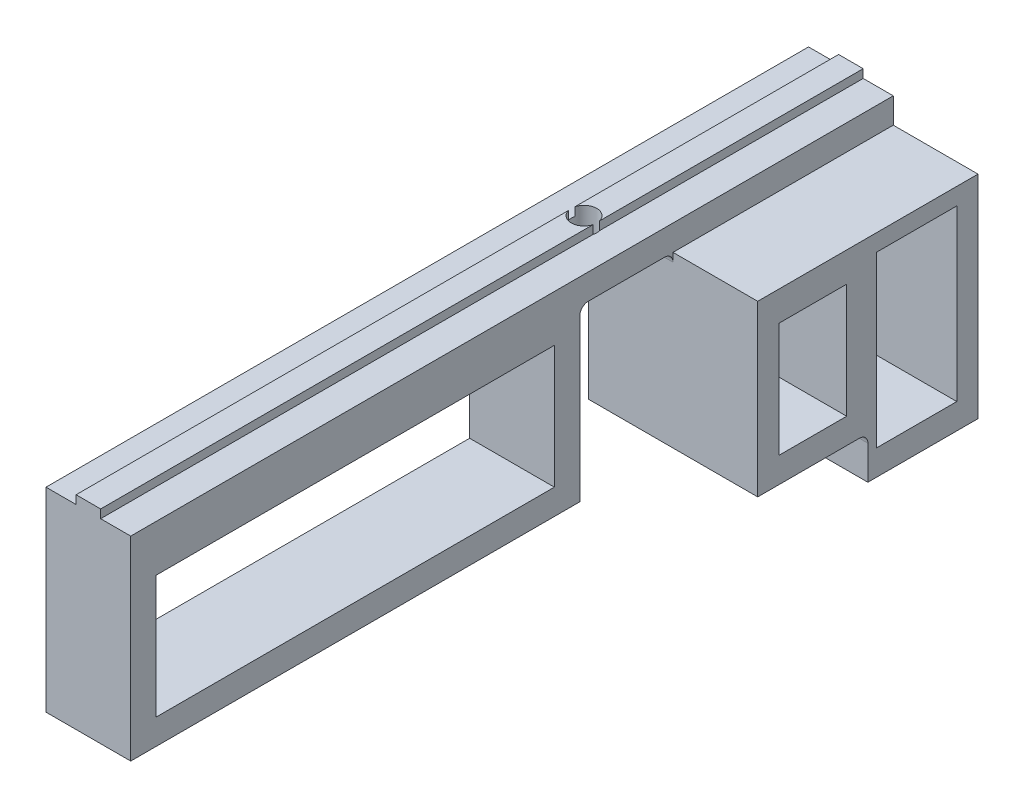
ISO-10303-21;
HEADER;
FILE_DESCRIPTION(('STEP AP214'),'2;1');
FILE_NAME('part.step','',(''),(''),'','','');
FILE_SCHEMA(('AUTOMOTIVE_DESIGN { 1 0 10303 214 1 1 1 1 }'));
ENDSEC;
DATA;
#1=APPLICATION_CONTEXT('core data for automotive mechanical design processes');
#2=APPLICATION_PROTOCOL_DEFINITION('international standard','automotive_design',2000,#1);
#3=PRODUCT_CONTEXT('',#1,'mechanical');
#4=PRODUCT('Part','Part','',(#3));
#5=PRODUCT_RELATED_PRODUCT_CATEGORY('part','',(#4));
#6=PRODUCT_DEFINITION_FORMATION('','',#4);
#7=PRODUCT_DEFINITION_CONTEXT('part definition',#1,'design');
#8=PRODUCT_DEFINITION('design','',#6,#7);
#9=PRODUCT_DEFINITION_SHAPE('','',#8);
#10=(LENGTH_UNIT() NAMED_UNIT(*) SI_UNIT(.MILLI.,.METRE.));
#11=(NAMED_UNIT(*) PLANE_ANGLE_UNIT() SI_UNIT($,.RADIAN.));
#12=(NAMED_UNIT(*) SI_UNIT($,.STERADIAN.) SOLID_ANGLE_UNIT());
#13=UNCERTAINTY_MEASURE_WITH_UNIT(LENGTH_MEASURE(1.E-05),#10,'distance_accuracy_value','');
#14=(GEOMETRIC_REPRESENTATION_CONTEXT(3) GLOBAL_UNCERTAINTY_ASSIGNED_CONTEXT((#13)) GLOBAL_UNIT_ASSIGNED_CONTEXT((#10,
#11,#12)) REPRESENTATION_CONTEXT('',''));
#15=CARTESIAN_POINT('',(0.,0.,0.));
#16=DIRECTION('',(0.,0.,1.));
#17=DIRECTION('',(1.,0.,0.));
#18=AXIS2_PLACEMENT_3D('',#15,#16,#17);
#19=CARTESIAN_POINT('',(-5.,0.,45.));
#20=DIRECTION('',(0.,1.,0.));
#21=DIRECTION('',(-1.,0.,0.));
#22=AXIS2_PLACEMENT_3D('',#19,#20,#21);
#23=PLANE('',#22);
#24=CARTESIAN_POINT('',(0.,0.,-13.5));
#25=DIRECTION('',(0.,-1.,0.));
#26=DIRECTION('',(1.,0.,0.));
#27=AXIS2_PLACEMENT_3D('',#24,#25,#26);
#28=CIRCLE('',#27,1.5);
#29=CARTESIAN_POINT('',(1.5,0.,-13.5));
#30=VERTEX_POINT('',#29);
#31=EDGE_CURVE('E416',#30,#30,#28,.T.);
#32=ORIENTED_EDGE('',*,*,#31,.F.);
#33=EDGE_LOOP('',(#32));
#34=FACE_BOUND('',#33,.T.);
#35=DIRECTION('',(0.,0.,-1.));
#36=VECTOR('',#35,1.);
#37=CARTESIAN_POINT('',(5.,0.,45.));
#38=LINE('',#37,#36);
#39=CARTESIAN_POINT('',(5.,0.,-8.99999999999999));
#40=VERTEX_POINT('',#39);
#41=CARTESIAN_POINT('',(5.,0.,-18.));
#42=VERTEX_POINT('',#41);
#43=EDGE_CURVE('E497',#40,#42,#38,.T.);
#44=ORIENTED_EDGE('',*,*,#43,.F.);
#45=DIRECTION('',(-1.,0.,0.));
#46=VECTOR('',#45,1.);
#47=CARTESIAN_POINT('',(-5.,0.,-9.00000000000001));
#48=LINE('',#47,#46);
#49=CARTESIAN_POINT('',(-5.,0.,-8.99999999999999));
#50=VERTEX_POINT('',#49);
#51=EDGE_CURVE('E512',#40,#50,#48,.T.);
#52=ORIENTED_EDGE('',*,*,#51,.T.);
#53=DIRECTION('',(0.,0.,-1.));
#54=VECTOR('',#53,1.);
#55=CARTESIAN_POINT('',(-5.,0.,45.));
#56=LINE('',#55,#54);
#57=CARTESIAN_POINT('',(-5.,0.,-18.));
#58=VERTEX_POINT('',#57);
#59=EDGE_CURVE('E499',#50,#58,#56,.T.);
#60=ORIENTED_EDGE('',*,*,#59,.T.);
#61=DIRECTION('',(-1.,0.,0.));
#62=VECTOR('',#61,1.);
#63=CARTESIAN_POINT('',(-5.,0.,-18.));
#64=LINE('',#63,#62);
#65=EDGE_CURVE('E510',#58,#42,#64,.F.);
#66=ORIENTED_EDGE('',*,*,#65,.T.);
#67=EDGE_LOOP('',(#44,#52,#60,#66));
#68=FACE_BOUND('',#67,.T.);
#69=ADVANCED_FACE('F33',(#34,#68),#23,.F.);
#70=CARTESIAN_POINT('',(1.45,3.,45.));
#71=DIRECTION('',(-1.,0.,0.));
#72=DIRECTION('',(0.,-1.,0.));
#73=AXIS2_PLACEMENT_3D('',#70,#71,#72);
#74=PLANE('',#73);
#75=DIRECTION('',(0.,0.,-1.));
#76=VECTOR('',#75,1.);
#77=CARTESIAN_POINT('',(1.45,4.,45.));
#78=LINE('',#77,#76);
#79=CARTESIAN_POINT('',(1.45,4.,-13.8840572873934));
#80=VERTEX_POINT('',#79);
#81=CARTESIAN_POINT('',(1.45,4.,-45.));
#82=VERTEX_POINT('',#81);
#83=EDGE_CURVE('E485',#80,#82,#78,.T.);
#84=ORIENTED_EDGE('',*,*,#83,.F.);
#85=DIRECTION('',(0.,-1.,0.));
#86=VECTOR('',#85,1.);
#87=CARTESIAN_POINT('',(1.45,4.,-13.8840572873934));
#88=LINE('',#87,#86);
#89=CARTESIAN_POINT('',(1.45,3.,-13.8840572873934));
#90=VERTEX_POINT('',#89);
#91=EDGE_CURVE('E439',#80,#90,#88,.T.);
#92=ORIENTED_EDGE('',*,*,#91,.T.);
#93=DIRECTION('',(0.,0.,-1.));
#94=VECTOR('',#93,1.);
#95=CARTESIAN_POINT('',(1.45,3.,45.));
#96=LINE('',#95,#94);
#97=CARTESIAN_POINT('',(1.45,3.,-45.));
#98=VERTEX_POINT('',#97);
#99=EDGE_CURVE('E489',#90,#98,#96,.T.);
#100=ORIENTED_EDGE('',*,*,#99,.T.);
#101=DIRECTION('',(0.,1.,0.));
#102=VECTOR('',#101,1.);
#103=CARTESIAN_POINT('',(1.45,3.,-45.));
#104=LINE('',#103,#102);
#105=EDGE_CURVE('E465',#98,#82,#104,.T.);
#106=ORIENTED_EDGE('',*,*,#105,.T.);
#107=EDGE_LOOP('',(#84,#92,#100,#106));
#108=FACE_BOUND('',#107,.T.);
#109=ADVANCED_FACE('F643',(#108),#74,.F.);
#110=CARTESIAN_POINT('',(1.45,4.,45.));
#111=DIRECTION('',(0.,-1.,0.));
#112=DIRECTION('',(0.,0.,-1.));
#113=AXIS2_PLACEMENT_3D('',#110,#111,#112);
#114=PLANE('',#113);
#115=CARTESIAN_POINT('',(1.45,4.,45.));
#116=VERTEX_POINT('',#115);
#117=CARTESIAN_POINT('',(1.45,4.,-13.1159427126066));
#118=VERTEX_POINT('',#117);
#119=EDGE_CURVE('E486',#116,#118,#78,.T.);
#120=ORIENTED_EDGE('',*,*,#119,.T.);
#121=CARTESIAN_POINT('',(0.,4.,-13.5));
#122=DIRECTION('',(0.,-1.,0.));
#123=DIRECTION('',(1.,0.,0.));
#124=AXIS2_PLACEMENT_3D('',#121,#122,#123);
#125=CIRCLE('',#124,1.5);
#126=CARTESIAN_POINT('',(-1.45,4.,-13.1159427126066));
#127=VERTEX_POINT('',#126);
#128=EDGE_CURVE('E421',#118,#127,#125,.T.);
#129=ORIENTED_EDGE('',*,*,#128,.T.);
#130=DIRECTION('',(0.,0.,-1.));
#131=VECTOR('',#130,1.);
#132=CARTESIAN_POINT('',(-1.45,4.,45.));
#133=LINE('',#132,#131);
#134=CARTESIAN_POINT('',(-1.45,4.,45.));
#135=VERTEX_POINT('',#134);
#136=EDGE_CURVE('E482',#135,#127,#133,.T.);
#137=ORIENTED_EDGE('',*,*,#136,.F.);
#138=DIRECTION('',(-1.,0.,0.));
#139=VECTOR('',#138,1.);
#140=CARTESIAN_POINT('',(1.45,4.,45.));
#141=LINE('',#140,#139);
#142=EDGE_CURVE('E452',#116,#135,#141,.T.);
#143=ORIENTED_EDGE('',*,*,#142,.F.);
#144=EDGE_LOOP('',(#120,#129,#137,#143));
#145=FACE_BOUND('',#144,.T.);
#146=ADVANCED_FACE('F649',(#145),#114,.F.);
#147=CARTESIAN_POINT('',(-1.45,4.,45.));
#148=DIRECTION('',(1.,0.,0.));
#149=DIRECTION('',(0.,1.,0.));
#150=AXIS2_PLACEMENT_3D('',#147,#148,#149);
#151=PLANE('',#150);
#152=ORIENTED_EDGE('',*,*,#136,.T.);
#153=DIRECTION('',(0.,-1.,0.));
#154=VECTOR('',#153,1.);
#155=CARTESIAN_POINT('',(-1.45,4.,-13.1159427126066));
#156=LINE('',#155,#154);
#157=CARTESIAN_POINT('',(-1.45,3.,-13.1159427126066));
#158=VERTEX_POINT('',#157);
#159=EDGE_CURVE('E430',#127,#158,#156,.T.);
#160=ORIENTED_EDGE('',*,*,#159,.T.);
#161=DIRECTION('',(0.,0.,-1.));
#162=VECTOR('',#161,1.);
#163=CARTESIAN_POINT('',(-1.45,3.,45.));
#164=LINE('',#163,#162);
#165=CARTESIAN_POINT('',(-1.45,3.,45.));
#166=VERTEX_POINT('',#165);
#167=EDGE_CURVE('E478',#166,#158,#164,.T.);
#168=ORIENTED_EDGE('',*,*,#167,.F.);
#169=DIRECTION('',(0.,-1.,0.));
#170=VECTOR('',#169,1.);
#171=CARTESIAN_POINT('',(-1.45,4.,45.));
#172=LINE('',#171,#170);
#173=EDGE_CURVE('E454',#135,#166,#172,.T.);
#174=ORIENTED_EDGE('',*,*,#173,.F.);
#175=EDGE_LOOP('',(#152,#160,#168,#174));
#176=FACE_BOUND('',#175,.T.);
#177=ADVANCED_FACE('F626',(#176),#151,.F.);
#178=CARTESIAN_POINT('',(-5.,3.,45.));
#179=DIRECTION('',(1.,0.,0.));
#180=DIRECTION('',(0.,1.,0.));
#181=AXIS2_PLACEMENT_3D('',#178,#179,#180);
#182=PLANE('',#181);
#183=DIRECTION('',(0.,-1.,0.));
#184=VECTOR('',#183,1.);
#185=CARTESIAN_POINT('',(-5.,3.,-45.));
#186=LINE('',#185,#184);
#187=CARTESIAN_POINT('',(-5.,3.,-45.));
#188=VERTEX_POINT('',#187);
#189=CARTESIAN_POINT('',(-4.99999999999999,-25.,-45.));
#190=VERTEX_POINT('',#189);
#191=EDGE_CURVE('E442',#188,#190,#186,.T.);
#192=ORIENTED_EDGE('',*,*,#191,.T.);
#193=DIRECTION('',(0.,0.,1.));
#194=VECTOR('',#193,1.);
#195=CARTESIAN_POINT('',(-4.99999999999999,-25.,-32.));
#196=LINE('',#195,#194);
#197=CARTESIAN_POINT('',(-4.99999999999999,-25.,-32.));
#198=VERTEX_POINT('',#197);
#199=EDGE_CURVE('E388',#190,#198,#196,.T.);
#200=ORIENTED_EDGE('',*,*,#199,.T.);
#201=DIRECTION('',(0.,1.,0.));
#202=VECTOR('',#201,1.);
#203=CARTESIAN_POINT('',(-4.99999999999999,-25.,-32.));
#204=LINE('',#203,#202);
#205=CARTESIAN_POINT('',(-4.99999999999999,-21.,-32.));
#206=VERTEX_POINT('',#205);
#207=EDGE_CURVE('E399',#198,#206,#204,.T.);
#208=ORIENTED_EDGE('',*,*,#207,.T.);
#209=CARTESIAN_POINT('',(-4.99999999999999,-21.,-31.));
#210=DIRECTION('',(1.,0.,0.));
#211=DIRECTION('',(0.,1.,0.));
#212=AXIS2_PLACEMENT_3D('',#209,#210,#211);
#213=CIRCLE('',#212,1.);
#214=CARTESIAN_POINT('',(-4.99999999999999,-20.,-31.));
#215=VERTEX_POINT('',#214);
#216=EDGE_CURVE('E521',#206,#215,#213,.T.);
#217=ORIENTED_EDGE('',*,*,#216,.T.);
#218=DIRECTION('',(0.,0.,1.));
#219=VECTOR('',#218,1.);
#220=CARTESIAN_POINT('',(-4.99999999999999,-20.,-32.));
#221=LINE('',#220,#219);
#222=CARTESIAN_POINT('',(-4.99999999999999,-20.,-19.));
#223=VERTEX_POINT('',#222);
#224=EDGE_CURVE('E352',#215,#223,#221,.T.);
#225=ORIENTED_EDGE('',*,*,#224,.T.);
#226=DIRECTION('',(0.,1.,0.));
#227=VECTOR('',#226,1.);
#228=CARTESIAN_POINT('',(-5.,0.,-19.));
#229=LINE('',#228,#227);
#230=CARTESIAN_POINT('',(-5.,-0.999999999999999,-19.));
#231=VERTEX_POINT('',#230);
#232=EDGE_CURVE('E341',#223,#231,#229,.T.);
#233=ORIENTED_EDGE('',*,*,#232,.T.);
#234=CARTESIAN_POINT('',(-5.,-1.,-18.));
#235=DIRECTION('',(1.,0.,0.));
#236=DIRECTION('',(0.,1.,0.));
#237=AXIS2_PLACEMENT_3D('',#234,#235,#236);
#238=CIRCLE('',#237,1.);
#239=EDGE_CURVE('E41',#231,#58,#238,.T.);
#240=ORIENTED_EDGE('',*,*,#239,.T.);
#241=ORIENTED_EDGE('',*,*,#59,.F.);
#242=CARTESIAN_POINT('',(-5.,-1.,-9.00000000000001));
#243=DIRECTION('',(1.,0.,0.));
#244=DIRECTION('',(0.,1.,0.));
#245=AXIS2_PLACEMENT_3D('',#242,#243,#244);
#246=CIRCLE('',#245,1.);
#247=CARTESIAN_POINT('',(-5.,-1.,-8.));
#248=VERTEX_POINT('',#247);
#249=EDGE_CURVE('E525',#50,#248,#246,.T.);
#250=ORIENTED_EDGE('',*,*,#249,.T.);
#251=DIRECTION('',(0.,-1.,0.));
#252=VECTOR('',#251,1.);
#253=CARTESIAN_POINT('',(-5.,0.,-8.));
#254=LINE('',#253,#252);
#255=CARTESIAN_POINT('',(-4.99999999999999,-20.,-8.));
#256=VERTEX_POINT('',#255);
#257=EDGE_CURVE('E296',#248,#256,#254,.T.);
#258=ORIENTED_EDGE('',*,*,#257,.T.);
#259=DIRECTION('',(0.,0.,1.));
#260=VECTOR('',#259,1.);
#261=CARTESIAN_POINT('',(-4.99999999999999,-20.,-8.));
#262=LINE('',#261,#260);
#263=CARTESIAN_POINT('',(-4.99999999999999,-20.,45.));
#264=VERTEX_POINT('',#263);
#265=EDGE_CURVE('E303',#256,#264,#262,.T.);
#266=ORIENTED_EDGE('',*,*,#265,.T.);
#267=DIRECTION('',(0.,-1.,0.));
#268=VECTOR('',#267,1.);
#269=CARTESIAN_POINT('',(-5.,3.,45.));
#270=LINE('',#269,#268);
#271=CARTESIAN_POINT('',(-5.,3.,45.));
#272=VERTEX_POINT('',#271);
#273=EDGE_CURVE('E443',#272,#264,#270,.T.);
#274=ORIENTED_EDGE('',*,*,#273,.F.);
#275=DIRECTION('',(0.,0.,-1.));
#276=VECTOR('',#275,1.);
#277=CARTESIAN_POINT('',(-5.,3.,45.));
#278=LINE('',#277,#276);
#279=EDGE_CURVE('E458',#272,#188,#278,.T.);
#280=ORIENTED_EDGE('',*,*,#279,.T.);
#281=EDGE_LOOP('',(#192,#200,#208,#217,#225,#233,#240,#241,#250,#258,#266,#274,#280));
#282=FACE_BOUND('',#281,.T.);
#283=DIRECTION('',(0.,-1.,0.));
#284=VECTOR('',#283,1.);
#285=CARTESIAN_POINT('',(-5.,-2.,-42.5));
#286=LINE('',#285,#284);
#287=CARTESIAN_POINT('',(-5.,-2.,-42.5));
#288=VERTEX_POINT('',#287);
#289=CARTESIAN_POINT('',(-4.99999999999999,-22.,-42.5));
#290=VERTEX_POINT('',#289);
#291=EDGE_CURVE('E361',#288,#290,#286,.T.);
#292=ORIENTED_EDGE('',*,*,#291,.F.);
#293=DIRECTION('',(0.,0.,-1.));
#294=VECTOR('',#293,1.);
#295=CARTESIAN_POINT('',(-5.,-2.,-42.5));
#296=LINE('',#295,#294);
#297=CARTESIAN_POINT('',(-5.,-2.,-33.));
#298=VERTEX_POINT('',#297);
#299=EDGE_CURVE('E367',#298,#288,#296,.T.);
#300=ORIENTED_EDGE('',*,*,#299,.F.);
#301=DIRECTION('',(0.,1.,0.));
#302=VECTOR('',#301,1.);
#303=CARTESIAN_POINT('',(-5.,-2.,-33.));
#304=LINE('',#303,#302);
#305=CARTESIAN_POINT('',(-4.99999999999999,-22.,-33.));
#306=VERTEX_POINT('',#305);
#307=EDGE_CURVE('E381',#306,#298,#304,.T.);
#308=ORIENTED_EDGE('',*,*,#307,.F.);
#309=DIRECTION('',(0.,0.,1.));
#310=VECTOR('',#309,1.);
#311=CARTESIAN_POINT('',(-4.99999999999999,-22.,-42.5));
#312=LINE('',#311,#310);
#313=EDGE_CURVE('E378',#290,#306,#312,.T.);
#314=ORIENTED_EDGE('',*,*,#313,.F.);
#315=EDGE_LOOP('',(#292,#300,#308,#314));
#316=FACE_BOUND('',#315,.T.);
#317=DIRECTION('',(0.,-1.,0.));
#318=VECTOR('',#317,1.);
#319=CARTESIAN_POINT('',(-5.,-3.5,-29.5));
#320=LINE('',#319,#318);
#321=CARTESIAN_POINT('',(-5.,-3.5,-29.5));
#322=VERTEX_POINT('',#321);
#323=CARTESIAN_POINT('',(-4.99999999999999,-17.,-29.5));
#324=VERTEX_POINT('',#323);
#325=EDGE_CURVE('E313',#322,#324,#320,.T.);
#326=ORIENTED_EDGE('',*,*,#325,.F.);
#327=DIRECTION('',(0.,0.,-1.));
#328=VECTOR('',#327,1.);
#329=CARTESIAN_POINT('',(-5.,-3.5,-29.5));
#330=LINE('',#329,#328);
#331=CARTESIAN_POINT('',(-5.,-3.5,-21.5));
#332=VERTEX_POINT('',#331);
#333=EDGE_CURVE('E320',#332,#322,#330,.T.);
#334=ORIENTED_EDGE('',*,*,#333,.F.);
#335=DIRECTION('',(0.,1.,0.));
#336=VECTOR('',#335,1.);
#337=CARTESIAN_POINT('',(-5.,-3.5,-21.5));
#338=LINE('',#337,#336);
#339=CARTESIAN_POINT('',(-4.99999999999999,-17.,-21.5));
#340=VERTEX_POINT('',#339);
#341=EDGE_CURVE('E334',#340,#332,#338,.T.);
#342=ORIENTED_EDGE('',*,*,#341,.F.);
#343=DIRECTION('',(0.,0.,1.));
#344=VECTOR('',#343,1.);
#345=CARTESIAN_POINT('',(-4.99999999999999,-17.,-29.5));
#346=LINE('',#345,#344);
#347=EDGE_CURVE('E331',#324,#340,#346,.T.);
#348=ORIENTED_EDGE('',*,*,#347,.F.);
#349=EDGE_LOOP('',(#326,#334,#342,#348));
#350=FACE_BOUND('',#349,.T.);
#351=DIRECTION('',(0.,-1.,0.));
#352=VECTOR('',#351,1.);
#353=CARTESIAN_POINT('',(-5.,-2.5,-5.));
#354=LINE('',#353,#352);
#355=CARTESIAN_POINT('',(-5.,-2.5,-5.));
#356=VERTEX_POINT('',#355);
#357=CARTESIAN_POINT('',(-4.99999999999999,-17.,-5.));
#358=VERTEX_POINT('',#357);
#359=EDGE_CURVE('E264',#356,#358,#354,.T.);
#360=ORIENTED_EDGE('',*,*,#359,.F.);
#361=DIRECTION('',(0.,0.,-1.));
#362=VECTOR('',#361,1.);
#363=CARTESIAN_POINT('',(-5.,-2.5,-5.));
#364=LINE('',#363,#362);
#365=CARTESIAN_POINT('',(-5.,-2.5,42.));
#366=VERTEX_POINT('',#365);
#367=EDGE_CURVE('E281',#366,#356,#364,.T.);
#368=ORIENTED_EDGE('',*,*,#367,.F.);
#369=DIRECTION('',(0.,1.,0.));
#370=VECTOR('',#369,1.);
#371=CARTESIAN_POINT('',(-5.,-2.5,42.));
#372=LINE('',#371,#370);
#373=CARTESIAN_POINT('',(-4.99999999999999,-17.,42.));
#374=VERTEX_POINT('',#373);
#375=EDGE_CURVE('E284',#374,#366,#372,.T.);
#376=ORIENTED_EDGE('',*,*,#375,.F.);
#377=DIRECTION('',(0.,0.,1.));
#378=VECTOR('',#377,1.);
#379=CARTESIAN_POINT('',(-4.99999999999999,-17.,-5.));
#380=LINE('',#379,#378);
#381=EDGE_CURVE('E290',#358,#374,#380,.T.);
#382=ORIENTED_EDGE('',*,*,#381,.F.);
#383=EDGE_LOOP('',(#360,#368,#376,#382));
#384=FACE_BOUND('',#383,.T.);
#385=ADVANCED_FACE('F530',(#282,#316,#350,#384),#182,.F.);
#386=CARTESIAN_POINT('',(5.,0.,45.));
#387=DIRECTION('',(-1.,0.,0.));
#388=DIRECTION('',(0.,-1.,0.));
#389=AXIS2_PLACEMENT_3D('',#386,#387,#388);
#390=PLANE('',#389);
#391=DIRECTION('',(0.,1.,0.));
#392=VECTOR('',#391,1.);
#393=CARTESIAN_POINT('',(5.,0.,-45.));
#394=LINE('',#393,#392);
#395=CARTESIAN_POINT('',(5.,0.,-45.));
#396=VERTEX_POINT('',#395);
#397=CARTESIAN_POINT('',(5.,3.,-45.));
#398=VERTEX_POINT('',#397);
#399=EDGE_CURVE('E460',#396,#398,#394,.T.);
#400=ORIENTED_EDGE('',*,*,#399,.T.);
#401=DIRECTION('',(0.,0.,-1.));
#402=VECTOR('',#401,1.);
#403=CARTESIAN_POINT('',(5.,3.,45.));
#404=LINE('',#403,#402);
#405=CARTESIAN_POINT('',(5.,3.,45.));
#406=VERTEX_POINT('',#405);
#407=EDGE_CURVE('E493',#406,#398,#404,.T.);
#408=ORIENTED_EDGE('',*,*,#407,.F.);
#409=DIRECTION('',(0.,1.,0.));
#410=VECTOR('',#409,1.);
#411=CARTESIAN_POINT('',(5.,0.,45.));
#412=LINE('',#411,#410);
#413=CARTESIAN_POINT('',(5.00000000000001,-20.,45.));
#414=VERTEX_POINT('',#413);
#415=EDGE_CURVE('E445',#414,#406,#412,.T.);
#416=ORIENTED_EDGE('',*,*,#415,.F.);
#417=DIRECTION('',(0.,0.,1.));
#418=VECTOR('',#417,1.);
#419=CARTESIAN_POINT('',(5.00000000000001,-20.,-8.));
#420=LINE('',#419,#418);
#421=CARTESIAN_POINT('',(5.00000000000001,-20.,-8.));
#422=VERTEX_POINT('',#421);
#423=EDGE_CURVE('E302',#422,#414,#420,.T.);
#424=ORIENTED_EDGE('',*,*,#423,.F.);
#425=DIRECTION('',(0.,-1.,0.));
#426=VECTOR('',#425,1.);
#427=CARTESIAN_POINT('',(5.,0.,-8.));
#428=LINE('',#427,#426);
#429=CARTESIAN_POINT('',(5.,-0.999999999999998,-8.));
#430=VERTEX_POINT('',#429);
#431=EDGE_CURVE('E300',#430,#422,#428,.T.);
#432=ORIENTED_EDGE('',*,*,#431,.F.);
#433=CARTESIAN_POINT('',(5.,-0.999999999999998,-9.00000000000001));
#434=DIRECTION('',(-1.,0.,0.));
#435=DIRECTION('',(0.,-1.,0.));
#436=AXIS2_PLACEMENT_3D('',#433,#434,#435);
#437=CIRCLE('',#436,1.);
#438=EDGE_CURVE('E527',#430,#40,#437,.T.);
#439=ORIENTED_EDGE('',*,*,#438,.T.);
#440=ORIENTED_EDGE('',*,*,#43,.T.);
#441=CARTESIAN_POINT('',(5.,-0.999999999999998,-18.));
#442=DIRECTION('',(-1.,0.,0.));
#443=DIRECTION('',(0.,-1.,0.));
#444=AXIS2_PLACEMENT_3D('',#441,#442,#443);
#445=CIRCLE('',#444,1.);
#446=CARTESIAN_POINT('',(5.,-0.999999999999998,-19.));
#447=VERTEX_POINT('',#446);
#448=EDGE_CURVE('E11',#42,#447,#445,.T.);
#449=ORIENTED_EDGE('',*,*,#448,.T.);
#450=DIRECTION('',(0.,-1.,0.));
#451=VECTOR('',#450,1.);
#452=CARTESIAN_POINT('',(5.,0.,-19.));
#453=LINE('',#452,#451);
#454=CARTESIAN_POINT('',(5.,0.,-19.));
#455=VERTEX_POINT('',#454);
#456=EDGE_CURVE('E47',#455,#447,#453,.T.);
#457=ORIENTED_EDGE('',*,*,#456,.F.);
#458=EDGE_CURVE('E496',#455,#396,#38,.T.);
#459=ORIENTED_EDGE('',*,*,#458,.T.);
#460=EDGE_LOOP('',(#400,#408,#416,#424,#432,#439,#440,#449,#457,#459));
#461=FACE_BOUND('',#460,.T.);
#462=DIRECTION('',(0.,0.,-1.));
#463=VECTOR('',#462,1.);
#464=CARTESIAN_POINT('',(5.,-2.5,-5.));
#465=LINE('',#464,#463);
#466=CARTESIAN_POINT('',(5.,-2.5,42.));
#467=VERTEX_POINT('',#466);
#468=CARTESIAN_POINT('',(5.,-2.5,-5.));
#469=VERTEX_POINT('',#468);
#470=EDGE_CURVE('E269',#467,#469,#465,.T.);
#471=ORIENTED_EDGE('',*,*,#470,.T.);
#472=DIRECTION('',(0.,-1.,0.));
#473=VECTOR('',#472,1.);
#474=CARTESIAN_POINT('',(5.,-2.5,-5.));
#475=LINE('',#474,#473);
#476=CARTESIAN_POINT('',(5.00000000000001,-17.,-5.));
#477=VERTEX_POINT('',#476);
#478=EDGE_CURVE('E261',#469,#477,#475,.T.);
#479=ORIENTED_EDGE('',*,*,#478,.T.);
#480=DIRECTION('',(0.,0.,1.));
#481=VECTOR('',#480,1.);
#482=CARTESIAN_POINT('',(5.00000000000001,-17.,-5.));
#483=LINE('',#482,#481);
#484=CARTESIAN_POINT('',(5.00000000000001,-17.,42.));
#485=VERTEX_POINT('',#484);
#486=EDGE_CURVE('E273',#477,#485,#483,.T.);
#487=ORIENTED_EDGE('',*,*,#486,.T.);
#488=DIRECTION('',(0.,1.,0.));
#489=VECTOR('',#488,1.);
#490=CARTESIAN_POINT('',(5.,-2.5,42.));
#491=LINE('',#490,#489);
#492=EDGE_CURVE('E277',#485,#467,#491,.T.);
#493=ORIENTED_EDGE('',*,*,#492,.T.);
#494=EDGE_LOOP('',(#471,#479,#487,#493));
#495=FACE_BOUND('',#494,.T.);
#496=ADVANCED_FACE('F279',(#461,#495),#390,.F.);
#497=CARTESIAN_POINT('',(5.,3.,45.));
#498=DIRECTION('',(0.,-1.,0.));
#499=DIRECTION('',(1.,0.,0.));
#500=AXIS2_PLACEMENT_3D('',#497,#498,#499);
#501=PLANE('',#500);
#502=ORIENTED_EDGE('',*,*,#99,.F.);
#503=CARTESIAN_POINT('',(0.,3.,-13.5));
#504=DIRECTION('',(0.,-1.,0.));
#505=DIRECTION('',(1.,0.,0.));
#506=AXIS2_PLACEMENT_3D('',#503,#504,#505);
#507=CIRCLE('',#506,1.5);
#508=CARTESIAN_POINT('',(1.45,3.,-13.1159427126066));
#509=VERTEX_POINT('',#508);
#510=EDGE_CURVE('E436',#90,#509,#507,.T.);
#511=ORIENTED_EDGE('',*,*,#510,.T.);
#512=CARTESIAN_POINT('',(1.45,3.,45.));
#513=VERTEX_POINT('',#512);
#514=EDGE_CURVE('E490',#513,#509,#96,.T.);
#515=ORIENTED_EDGE('',*,*,#514,.F.);
#516=DIRECTION('',(-1.,0.,0.));
#517=VECTOR('',#516,1.);
#518=CARTESIAN_POINT('',(5.,3.,45.));
#519=LINE('',#518,#517);
#520=EDGE_CURVE('E448',#406,#513,#519,.T.);
#521=ORIENTED_EDGE('',*,*,#520,.F.);
#522=ORIENTED_EDGE('',*,*,#407,.T.);
#523=DIRECTION('',(-1.,0.,0.));
#524=VECTOR('',#523,1.);
#525=CARTESIAN_POINT('',(5.,3.,-45.));
#526=LINE('',#525,#524);
#527=EDGE_CURVE('E462',#398,#98,#526,.T.);
#528=ORIENTED_EDGE('',*,*,#527,.T.);
#529=EDGE_LOOP('',(#502,#511,#515,#521,#522,#528));
#530=FACE_BOUND('',#529,.T.);
#531=ADVANCED_FACE('F558',(#530),#501,.F.);
#532=ORIENTED_EDGE('',*,*,#514,.T.);
#533=DIRECTION('',(0.,-1.,0.));
#534=VECTOR('',#533,1.);
#535=CARTESIAN_POINT('',(1.45,4.,-13.1159427126066));
#536=LINE('',#535,#534);
#537=EDGE_CURVE('E433',#509,#118,#536,.F.);
#538=ORIENTED_EDGE('',*,*,#537,.T.);
#539=ORIENTED_EDGE('',*,*,#119,.F.);
#540=DIRECTION('',(0.,1.,0.));
#541=VECTOR('',#540,1.);
#542=CARTESIAN_POINT('',(1.45,3.,45.));
#543=LINE('',#542,#541);
#544=EDGE_CURVE('E450',#513,#116,#543,.T.);
#545=ORIENTED_EDGE('',*,*,#544,.F.);
#546=EDGE_LOOP('',(#532,#538,#539,#545));
#547=FACE_BOUND('',#546,.T.);
#548=ADVANCED_FACE('F652',(#547),#74,.F.);
#549=CARTESIAN_POINT('',(-1.45,4.,-13.8840572873934));
#550=VERTEX_POINT('',#549);
#551=CARTESIAN_POINT('',(-1.45,4.,-45.));
#552=VERTEX_POINT('',#551);
#553=EDGE_CURVE('E481',#550,#552,#133,.T.);
#554=ORIENTED_EDGE('',*,*,#553,.F.);
#555=EDGE_CURVE('E425',#550,#80,#125,.T.);
#556=ORIENTED_EDGE('',*,*,#555,.T.);
#557=ORIENTED_EDGE('',*,*,#83,.T.);
#558=DIRECTION('',(-1.,0.,0.));
#559=VECTOR('',#558,1.);
#560=CARTESIAN_POINT('',(1.45,4.,-45.));
#561=LINE('',#560,#559);
#562=EDGE_CURVE('E468',#82,#552,#561,.T.);
#563=ORIENTED_EDGE('',*,*,#562,.T.);
#564=EDGE_LOOP('',(#554,#556,#557,#563));
#565=FACE_BOUND('',#564,.T.);
#566=ADVANCED_FACE('F903',(#565),#114,.F.);
#567=CARTESIAN_POINT('',(-1.45,3.,-13.8840572873934));
#568=VERTEX_POINT('',#567);
#569=CARTESIAN_POINT('',(-1.45,3.,-45.));
#570=VERTEX_POINT('',#569);
#571=EDGE_CURVE('E477',#568,#570,#164,.T.);
#572=ORIENTED_EDGE('',*,*,#571,.F.);
#573=DIRECTION('',(0.,-1.,0.));
#574=VECTOR('',#573,1.);
#575=CARTESIAN_POINT('',(-1.45,4.,-13.8840572873934));
#576=LINE('',#575,#574);
#577=EDGE_CURVE('E424',#568,#550,#576,.F.);
#578=ORIENTED_EDGE('',*,*,#577,.T.);
#579=ORIENTED_EDGE('',*,*,#553,.T.);
#580=DIRECTION('',(0.,-1.,0.));
#581=VECTOR('',#580,1.);
#582=CARTESIAN_POINT('',(-1.45,4.,-45.));
#583=LINE('',#582,#581);
#584=EDGE_CURVE('E471',#552,#570,#583,.T.);
#585=ORIENTED_EDGE('',*,*,#584,.T.);
#586=EDGE_LOOP('',(#572,#578,#579,#585));
#587=FACE_BOUND('',#586,.T.);
#588=ADVANCED_FACE('F894',(#587),#151,.F.);
#589=CARTESIAN_POINT('',(-1.45,3.,45.));
#590=DIRECTION('',(0.,-1.,0.));
#591=DIRECTION('',(1.,0.,0.));
#592=AXIS2_PLACEMENT_3D('',#589,#590,#591);
#593=PLANE('',#592);
#594=ORIENTED_EDGE('',*,*,#167,.T.);
#595=CARTESIAN_POINT('',(0.,3.,-13.5));
#596=DIRECTION('',(0.,-1.,0.));
#597=DIRECTION('',(1.,0.,0.));
#598=AXIS2_PLACEMENT_3D('',#595,#596,#597);
#599=CIRCLE('',#598,1.5);
#600=EDGE_CURVE('E502',#158,#568,#599,.T.);
#601=ORIENTED_EDGE('',*,*,#600,.T.);
#602=ORIENTED_EDGE('',*,*,#571,.T.);
#603=DIRECTION('',(-1.,0.,0.));
#604=VECTOR('',#603,1.);
#605=CARTESIAN_POINT('',(-1.45,3.,-45.));
#606=LINE('',#605,#604);
#607=EDGE_CURVE('E446',#570,#188,#606,.T.);
#608=ORIENTED_EDGE('',*,*,#607,.T.);
#609=ORIENTED_EDGE('',*,*,#279,.F.);
#610=DIRECTION('',(-1.,0.,0.));
#611=VECTOR('',#610,1.);
#612=CARTESIAN_POINT('',(-1.45,3.,45.));
#613=LINE('',#612,#611);
#614=EDGE_CURVE('E456',#166,#272,#613,.T.);
#615=ORIENTED_EDGE('',*,*,#614,.F.);
#616=EDGE_LOOP('',(#594,#601,#602,#608,#609,#615));
#617=FACE_BOUND('',#616,.T.);
#618=ADVANCED_FACE('F789',(#617),#593,.F.);
#619=CARTESIAN_POINT('',(0.,0.,45.));
#620=DIRECTION('',(0.,0.,1.));
#621=DIRECTION('',(1.,0.,0.));
#622=AXIS2_PLACEMENT_3D('',#619,#620,#621);
#623=PLANE('',#622);
#624=ORIENTED_EDGE('',*,*,#273,.T.);
#625=DIRECTION('',(-1.,0.,0.));
#626=VECTOR('',#625,1.);
#627=CARTESIAN_POINT('',(5.00000000000001,-20.,45.));
#628=LINE('',#627,#626);
#629=EDGE_CURVE('E310',#414,#264,#628,.T.);
#630=ORIENTED_EDGE('',*,*,#629,.F.);
#631=ORIENTED_EDGE('',*,*,#415,.T.);
#632=ORIENTED_EDGE('',*,*,#520,.T.);
#633=ORIENTED_EDGE('',*,*,#544,.T.);
#634=ORIENTED_EDGE('',*,*,#142,.T.);
#635=ORIENTED_EDGE('',*,*,#173,.T.);
#636=ORIENTED_EDGE('',*,*,#614,.T.);
#637=EDGE_LOOP('',(#624,#630,#631,#632,#633,#634,#635,#636));
#638=FACE_BOUND('',#637,.T.);
#639=ADVANCED_FACE('F565',(#638),#623,.T.);
#640=CARTESIAN_POINT('',(0.,0.,-45.));
#641=DIRECTION('',(0.,0.,1.));
#642=DIRECTION('',(1.,0.,0.));
#643=AXIS2_PLACEMENT_3D('',#640,#641,#642);
#644=PLANE('',#643);
#645=ORIENTED_EDGE('',*,*,#191,.F.);
#646=ORIENTED_EDGE('',*,*,#607,.F.);
#647=ORIENTED_EDGE('',*,*,#584,.F.);
#648=ORIENTED_EDGE('',*,*,#562,.F.);
#649=ORIENTED_EDGE('',*,*,#105,.F.);
#650=ORIENTED_EDGE('',*,*,#527,.F.);
#651=ORIENTED_EDGE('',*,*,#399,.F.);
#652=DIRECTION('',(-1.,0.,0.));
#653=VECTOR('',#652,1.);
#654=CARTESIAN_POINT('',(15.,0.,-45.));
#655=LINE('',#654,#653);
#656=CARTESIAN_POINT('',(15.,0.,-45.));
#657=VERTEX_POINT('',#656);
#658=EDGE_CURVE('E413',#657,#396,#655,.T.);
#659=ORIENTED_EDGE('',*,*,#658,.F.);
#660=DIRECTION('',(0.,-1.,0.));
#661=VECTOR('',#660,1.);
#662=CARTESIAN_POINT('',(15.,-25.,-45.));
#663=LINE('',#662,#661);
#664=CARTESIAN_POINT('',(15.,-25.,-45.));
#665=VERTEX_POINT('',#664);
#666=EDGE_CURVE('E395',#657,#665,#663,.T.);
#667=ORIENTED_EDGE('',*,*,#666,.T.);
#668=DIRECTION('',(-1.,0.,0.));
#669=VECTOR('',#668,1.);
#670=CARTESIAN_POINT('',(15.,-25.,-45.));
#671=LINE('',#670,#669);
#672=EDGE_CURVE('E408',#665,#190,#671,.T.);
#673=ORIENTED_EDGE('',*,*,#672,.T.);
#674=EDGE_LOOP('',(#645,#646,#647,#648,#649,#650,#651,#659,#667,#673));
#675=FACE_BOUND('',#674,.T.);
#676=ADVANCED_FACE('F552',(#675),#644,.F.);
#677=CARTESIAN_POINT('',(0.,4.,-13.5));
#678=DIRECTION('',(0.,-1.,0.));
#679=DIRECTION('',(1.,0.,0.));
#680=AXIS2_PLACEMENT_3D('',#677,#678,#679);
#681=CYLINDRICAL_SURFACE('',#680,1.5);
#682=ORIENTED_EDGE('',*,*,#31,.T.);
#683=EDGE_LOOP('',(#682));
#684=FACE_BOUND('',#683,.T.);
#685=ORIENTED_EDGE('',*,*,#555,.F.);
#686=ORIENTED_EDGE('',*,*,#577,.F.);
#687=ORIENTED_EDGE('',*,*,#600,.F.);
#688=ORIENTED_EDGE('',*,*,#159,.F.);
#689=ORIENTED_EDGE('',*,*,#128,.F.);
#690=ORIENTED_EDGE('',*,*,#537,.F.);
#691=ORIENTED_EDGE('',*,*,#510,.F.);
#692=ORIENTED_EDGE('',*,*,#91,.F.);
#693=EDGE_LOOP('',(#685,#686,#687,#688,#689,#690,#691,#692));
#694=FACE_BOUND('',#693,.T.);
#695=ADVANCED_FACE('F827',(#684,#694),#681,.F.);
#696=CARTESIAN_POINT('',(15.,0.,-32.));
#697=DIRECTION('',(0.,1.,0.));
#698=DIRECTION('',(-1.,0.,0.));
#699=AXIS2_PLACEMENT_3D('',#696,#697,#698);
#700=PLANE('',#699);
#701=ORIENTED_EDGE('',*,*,#458,.F.);
#702=DIRECTION('',(-1.,0.,0.));
#703=VECTOR('',#702,1.);
#704=CARTESIAN_POINT('',(15.,0.,-19.));
#705=LINE('',#704,#703);
#706=CARTESIAN_POINT('',(15.,0.,-19.));
#707=VERTEX_POINT('',#706);
#708=EDGE_CURVE('E354',#707,#455,#705,.T.);
#709=ORIENTED_EDGE('',*,*,#708,.F.);
#710=DIRECTION('',(0.,0.,-1.));
#711=VECTOR('',#710,1.);
#712=CARTESIAN_POINT('',(15.,0.,-32.));
#713=LINE('',#712,#711);
#714=EDGE_CURVE('E405',#707,#657,#713,.T.);
#715=ORIENTED_EDGE('',*,*,#714,.T.);
#716=ORIENTED_EDGE('',*,*,#658,.T.);
#717=EDGE_LOOP('',(#701,#709,#715,#716));
#718=FACE_BOUND('',#717,.T.);
#719=ADVANCED_FACE('F546',(#718),#700,.T.);
#720=CARTESIAN_POINT('',(15.,-25.,-32.));
#721=DIRECTION('',(0.,0.,1.));
#722=DIRECTION('',(1.,0.,0.));
#723=AXIS2_PLACEMENT_3D('',#720,#721,#722);
#724=PLANE('',#723);
#725=DIRECTION('',(0.,1.,0.));
#726=VECTOR('',#725,1.);
#727=CARTESIAN_POINT('',(15.,-25.,-32.));
#728=LINE('',#727,#726);
#729=CARTESIAN_POINT('',(15.,-25.,-32.));
#730=VERTEX_POINT('',#729);
#731=CARTESIAN_POINT('',(15.,-21.,-32.));
#732=VERTEX_POINT('',#731);
#733=EDGE_CURVE('E402',#730,#732,#728,.T.);
#734=ORIENTED_EDGE('',*,*,#733,.T.);
#735=DIRECTION('',(-1.,0.,0.));
#736=VECTOR('',#735,1.);
#737=CARTESIAN_POINT('',(-5.,-21.,-32.));
#738=LINE('',#737,#736);
#739=EDGE_CURVE('E505',#732,#206,#738,.T.);
#740=ORIENTED_EDGE('',*,*,#739,.T.);
#741=ORIENTED_EDGE('',*,*,#207,.F.);
#742=DIRECTION('',(-1.,0.,0.));
#743=VECTOR('',#742,1.);
#744=CARTESIAN_POINT('',(15.,-25.,-32.));
#745=LINE('',#744,#743);
#746=EDGE_CURVE('E417',#730,#198,#745,.T.);
#747=ORIENTED_EDGE('',*,*,#746,.F.);
#748=EDGE_LOOP('',(#734,#740,#741,#747));
#749=FACE_BOUND('',#748,.T.);
#750=ADVANCED_FACE('F590',(#749),#724,.T.);
#751=CARTESIAN_POINT('',(15.,-25.,-32.));
#752=DIRECTION('',(0.,-1.,0.));
#753=DIRECTION('',(1.,0.,0.));
#754=AXIS2_PLACEMENT_3D('',#751,#752,#753);
#755=PLANE('',#754);
#756=ORIENTED_EDGE('',*,*,#199,.F.);
#757=ORIENTED_EDGE('',*,*,#672,.F.);
#758=DIRECTION('',(0.,0.,1.));
#759=VECTOR('',#758,1.);
#760=CARTESIAN_POINT('',(15.,-25.,-32.));
#761=LINE('',#760,#759);
#762=EDGE_CURVE('E398',#665,#730,#761,.T.);
#763=ORIENTED_EDGE('',*,*,#762,.T.);
#764=ORIENTED_EDGE('',*,*,#746,.T.);
#765=EDGE_LOOP('',(#756,#757,#763,#764));
#766=FACE_BOUND('',#765,.T.);
#767=ADVANCED_FACE('F586',(#766),#755,.T.);
#768=CARTESIAN_POINT('',(15.,0.,0.));
#769=DIRECTION('',(-1.,0.,0.));
#770=DIRECTION('',(0.,-1.,0.));
#771=AXIS2_PLACEMENT_3D('',#768,#769,#770);
#772=PLANE('',#771);
#773=DIRECTION('',(0.,0.,-1.));
#774=VECTOR('',#773,1.);
#775=CARTESIAN_POINT('',(15.,-1.99999999999999,-42.5));
#776=LINE('',#775,#774);
#777=CARTESIAN_POINT('',(15.,-1.99999999999999,-33.));
#778=VERTEX_POINT('',#777);
#779=CARTESIAN_POINT('',(15.,-1.99999999999999,-42.5));
#780=VERTEX_POINT('',#779);
#781=EDGE_CURVE('E373',#778,#780,#776,.T.);
#782=ORIENTED_EDGE('',*,*,#781,.T.);
#783=DIRECTION('',(0.,-1.,0.));
#784=VECTOR('',#783,1.);
#785=CARTESIAN_POINT('',(15.,-1.99999999999999,-42.5));
#786=LINE('',#785,#784);
#787=CARTESIAN_POINT('',(15.,-22.,-42.5));
#788=VERTEX_POINT('',#787);
#789=EDGE_CURVE('E363',#780,#788,#786,.T.);
#790=ORIENTED_EDGE('',*,*,#789,.T.);
#791=DIRECTION('',(0.,0.,1.));
#792=VECTOR('',#791,1.);
#793=CARTESIAN_POINT('',(15.,-22.,-42.5));
#794=LINE('',#793,#792);
#795=CARTESIAN_POINT('',(15.,-22.,-33.));
#796=VERTEX_POINT('',#795);
#797=EDGE_CURVE('E366',#788,#796,#794,.T.);
#798=ORIENTED_EDGE('',*,*,#797,.T.);
#799=DIRECTION('',(0.,1.,0.));
#800=VECTOR('',#799,1.);
#801=CARTESIAN_POINT('',(15.,-1.99999999999999,-33.));
#802=LINE('',#801,#800);
#803=EDGE_CURVE('E370',#796,#778,#802,.T.);
#804=ORIENTED_EDGE('',*,*,#803,.T.);
#805=EDGE_LOOP('',(#782,#790,#798,#804));
#806=FACE_BOUND('',#805,.T.);
#807=ORIENTED_EDGE('',*,*,#666,.F.);
#808=ORIENTED_EDGE('',*,*,#714,.F.);
#809=DIRECTION('',(0.,1.,0.));
#810=VECTOR('',#809,1.);
#811=CARTESIAN_POINT('',(15.,0.,-19.));
#812=LINE('',#811,#810);
#813=CARTESIAN_POINT('',(15.,-20.,-19.));
#814=VERTEX_POINT('',#813);
#815=EDGE_CURVE('E348',#814,#707,#812,.T.);
#816=ORIENTED_EDGE('',*,*,#815,.F.);
#817=DIRECTION('',(0.,0.,1.));
#818=VECTOR('',#817,1.);
#819=CARTESIAN_POINT('',(15.,-20.,-32.));
#820=LINE('',#819,#818);
#821=CARTESIAN_POINT('',(15.,-20.,-31.));
#822=VERTEX_POINT('',#821);
#823=EDGE_CURVE('E351',#822,#814,#820,.T.);
#824=ORIENTED_EDGE('',*,*,#823,.F.);
#825=CARTESIAN_POINT('',(15.,-21.,-31.));
#826=DIRECTION('',(-1.,0.,0.));
#827=DIRECTION('',(0.,-1.,0.));
#828=AXIS2_PLACEMENT_3D('',#825,#826,#827);
#829=CIRCLE('',#828,1.);
#830=EDGE_CURVE('E523',#822,#732,#829,.T.);
#831=ORIENTED_EDGE('',*,*,#830,.T.);
#832=ORIENTED_EDGE('',*,*,#733,.F.);
#833=ORIENTED_EDGE('',*,*,#762,.F.);
#834=EDGE_LOOP('',(#807,#808,#816,#824,#831,#832,#833));
#835=FACE_BOUND('',#834,.T.);
#836=DIRECTION('',(0.,0.,-1.));
#837=VECTOR('',#836,1.);
#838=CARTESIAN_POINT('',(15.,-3.49999999999999,-29.5));
#839=LINE('',#838,#837);
#840=CARTESIAN_POINT('',(15.,-3.49999999999999,-21.5));
#841=VERTEX_POINT('',#840);
#842=CARTESIAN_POINT('',(15.,-3.49999999999999,-29.5));
#843=VERTEX_POINT('',#842);
#844=EDGE_CURVE('E326',#841,#843,#839,.T.);
#845=ORIENTED_EDGE('',*,*,#844,.T.);
#846=DIRECTION('',(0.,-1.,0.));
#847=VECTOR('',#846,1.);
#848=CARTESIAN_POINT('',(15.,-3.49999999999999,-29.5));
#849=LINE('',#848,#847);
#850=CARTESIAN_POINT('',(15.,-17.,-29.5));
#851=VERTEX_POINT('',#850);
#852=EDGE_CURVE('E316',#843,#851,#849,.T.);
#853=ORIENTED_EDGE('',*,*,#852,.T.);
#854=DIRECTION('',(0.,0.,1.));
#855=VECTOR('',#854,1.);
#856=CARTESIAN_POINT('',(15.,-17.,-29.5));
#857=LINE('',#856,#855);
#858=CARTESIAN_POINT('',(15.,-17.,-21.5));
#859=VERTEX_POINT('',#858);
#860=EDGE_CURVE('E319',#851,#859,#857,.T.);
#861=ORIENTED_EDGE('',*,*,#860,.T.);
#862=DIRECTION('',(0.,1.,0.));
#863=VECTOR('',#862,1.);
#864=CARTESIAN_POINT('',(15.,-3.49999999999999,-21.5));
#865=LINE('',#864,#863);
#866=EDGE_CURVE('E323',#859,#841,#865,.T.);
#867=ORIENTED_EDGE('',*,*,#866,.T.);
#868=EDGE_LOOP('',(#845,#853,#861,#867));
#869=FACE_BOUND('',#868,.T.);
#870=ADVANCED_FACE('F601',(#806,#835,#869),#772,.F.);
#871=CARTESIAN_POINT('',(15.,-1.99999999999999,-42.5));
#872=DIRECTION('',(0.,0.,-1.));
#873=DIRECTION('',(-1.,0.,0.));
#874=AXIS2_PLACEMENT_3D('',#871,#872,#873);
#875=PLANE('',#874);
#876=ORIENTED_EDGE('',*,*,#291,.T.);
#877=DIRECTION('',(-1.,0.,0.));
#878=VECTOR('',#877,1.);
#879=CARTESIAN_POINT('',(15.,-22.,-42.5));
#880=LINE('',#879,#878);
#881=EDGE_CURVE('E376',#788,#290,#880,.T.);
#882=ORIENTED_EDGE('',*,*,#881,.F.);
#883=ORIENTED_EDGE('',*,*,#789,.F.);
#884=DIRECTION('',(-1.,0.,0.));
#885=VECTOR('',#884,1.);
#886=CARTESIAN_POINT('',(15.,-1.99999999999999,-42.5));
#887=LINE('',#886,#885);
#888=EDGE_CURVE('E386',#780,#288,#887,.T.);
#889=ORIENTED_EDGE('',*,*,#888,.T.);
#890=EDGE_LOOP('',(#876,#882,#883,#889));
#891=FACE_BOUND('',#890,.T.);
#892=ADVANCED_FACE('F604',(#891),#875,.F.);
#893=CARTESIAN_POINT('',(15.,-1.99999999999999,-42.5));
#894=DIRECTION('',(0.,1.,0.));
#895=DIRECTION('',(-1.,0.,0.));
#896=AXIS2_PLACEMENT_3D('',#893,#894,#895);
#897=PLANE('',#896);
#898=ORIENTED_EDGE('',*,*,#299,.T.);
#899=ORIENTED_EDGE('',*,*,#888,.F.);
#900=ORIENTED_EDGE('',*,*,#781,.F.);
#901=DIRECTION('',(-1.,0.,0.));
#902=VECTOR('',#901,1.);
#903=CARTESIAN_POINT('',(15.,-1.99999999999999,-33.));
#904=LINE('',#903,#902);
#905=EDGE_CURVE('E389',#778,#298,#904,.T.);
#906=ORIENTED_EDGE('',*,*,#905,.T.);
#907=EDGE_LOOP('',(#898,#899,#900,#906));
#908=FACE_BOUND('',#907,.T.);
#909=ADVANCED_FACE('F846',(#908),#897,.F.);
#910=CARTESIAN_POINT('',(15.,-1.99999999999999,-33.));
#911=DIRECTION('',(0.,0.,1.));
#912=DIRECTION('',(0.,-1.,0.));
#913=AXIS2_PLACEMENT_3D('',#910,#911,#912);
#914=PLANE('',#913);
#915=ORIENTED_EDGE('',*,*,#307,.T.);
#916=ORIENTED_EDGE('',*,*,#905,.F.);
#917=ORIENTED_EDGE('',*,*,#803,.F.);
#918=DIRECTION('',(-1.,0.,0.));
#919=VECTOR('',#918,1.);
#920=CARTESIAN_POINT('',(15.,-22.,-33.));
#921=LINE('',#920,#919);
#922=EDGE_CURVE('E391',#796,#306,#921,.T.);
#923=ORIENTED_EDGE('',*,*,#922,.T.);
#924=EDGE_LOOP('',(#915,#916,#917,#923));
#925=FACE_BOUND('',#924,.T.);
#926=ADVANCED_FACE('F836',(#925),#914,.F.);
#927=CARTESIAN_POINT('',(15.,-22.,-42.5));
#928=DIRECTION('',(0.,-1.,0.));
#929=DIRECTION('',(1.,0.,0.));
#930=AXIS2_PLACEMENT_3D('',#927,#928,#929);
#931=PLANE('',#930);
#932=ORIENTED_EDGE('',*,*,#313,.T.);
#933=ORIENTED_EDGE('',*,*,#922,.F.);
#934=ORIENTED_EDGE('',*,*,#797,.F.);
#935=ORIENTED_EDGE('',*,*,#881,.T.);
#936=EDGE_LOOP('',(#932,#933,#934,#935));
#937=FACE_BOUND('',#936,.T.);
#938=ADVANCED_FACE('F707',(#937),#931,.F.);
#939=CARTESIAN_POINT('',(15.,0.,-19.));
#940=DIRECTION('',(0.,0.,1.));
#941=DIRECTION('',(0.,-1.,0.));
#942=AXIS2_PLACEMENT_3D('',#939,#940,#941);
#943=PLANE('',#942);
#944=ORIENTED_EDGE('',*,*,#456,.T.);
#945=DIRECTION('',(-1.,0.,0.));
#946=VECTOR('',#945,1.);
#947=CARTESIAN_POINT('',(15.,-0.999999999999996,-19.));
#948=LINE('',#947,#946);
#949=EDGE_CURVE('E518',#447,#231,#948,.T.);
#950=ORIENTED_EDGE('',*,*,#949,.T.);
#951=ORIENTED_EDGE('',*,*,#232,.F.);
#952=DIRECTION('',(-1.,0.,0.));
#953=VECTOR('',#952,1.);
#954=CARTESIAN_POINT('',(15.,-20.,-19.));
#955=LINE('',#954,#953);
#956=EDGE_CURVE('E358',#814,#223,#955,.T.);
#957=ORIENTED_EDGE('',*,*,#956,.F.);
#958=ORIENTED_EDGE('',*,*,#815,.T.);
#959=ORIENTED_EDGE('',*,*,#708,.T.);
#960=EDGE_LOOP('',(#944,#950,#951,#957,#958,#959));
#961=FACE_BOUND('',#960,.T.);
#962=ADVANCED_FACE('F540',(#961),#943,.T.);
#963=CARTESIAN_POINT('',(15.,-20.,-32.));
#964=DIRECTION('',(0.,-1.,0.));
#965=DIRECTION('',(1.,0.,0.));
#966=AXIS2_PLACEMENT_3D('',#963,#964,#965);
#967=PLANE('',#966);
#968=ORIENTED_EDGE('',*,*,#224,.F.);
#969=DIRECTION('',(-1.,0.,0.));
#970=VECTOR('',#969,1.);
#971=CARTESIAN_POINT('',(15.,-20.,-31.));
#972=LINE('',#971,#970);
#973=EDGE_CURVE('E508',#215,#822,#972,.F.);
#974=ORIENTED_EDGE('',*,*,#973,.T.);
#975=ORIENTED_EDGE('',*,*,#823,.T.);
#976=ORIENTED_EDGE('',*,*,#956,.T.);
#977=EDGE_LOOP('',(#968,#974,#975,#976));
#978=FACE_BOUND('',#977,.T.);
#979=ADVANCED_FACE('F599',(#978),#967,.T.);
#980=CARTESIAN_POINT('',(15.,-3.49999999999999,-29.5));
#981=DIRECTION('',(0.,0.,-1.));
#982=DIRECTION('',(-1.,0.,0.));
#983=AXIS2_PLACEMENT_3D('',#980,#981,#982);
#984=PLANE('',#983);
#985=ORIENTED_EDGE('',*,*,#325,.T.);
#986=DIRECTION('',(-1.,0.,0.));
#987=VECTOR('',#986,1.);
#988=CARTESIAN_POINT('',(15.,-17.,-29.5));
#989=LINE('',#988,#987);
#990=EDGE_CURVE('E329',#851,#324,#989,.T.);
#991=ORIENTED_EDGE('',*,*,#990,.F.);
#992=ORIENTED_EDGE('',*,*,#852,.F.);
#993=DIRECTION('',(-1.,0.,0.));
#994=VECTOR('',#993,1.);
#995=CARTESIAN_POINT('',(15.,-3.49999999999999,-29.5));
#996=LINE('',#995,#994);
#997=EDGE_CURVE('E339',#843,#322,#996,.T.);
#998=ORIENTED_EDGE('',*,*,#997,.T.);
#999=EDGE_LOOP('',(#985,#991,#992,#998));
#1000=FACE_BOUND('',#999,.T.);
#1001=ADVANCED_FACE('F614',(#1000),#984,.F.);
#1002=CARTESIAN_POINT('',(15.,-3.49999999999999,-29.5));
#1003=DIRECTION('',(0.,1.,0.));
#1004=DIRECTION('',(-1.,0.,0.));
#1005=AXIS2_PLACEMENT_3D('',#1002,#1003,#1004);
#1006=PLANE('',#1005);
#1007=ORIENTED_EDGE('',*,*,#333,.T.);
#1008=ORIENTED_EDGE('',*,*,#997,.F.);
#1009=ORIENTED_EDGE('',*,*,#844,.F.);
#1010=DIRECTION('',(-1.,0.,0.));
#1011=VECTOR('',#1010,1.);
#1012=CARTESIAN_POINT('',(15.,-3.49999999999999,-21.5));
#1013=LINE('',#1012,#1011);
#1014=EDGE_CURVE('E342',#841,#332,#1013,.T.);
#1015=ORIENTED_EDGE('',*,*,#1014,.T.);
#1016=EDGE_LOOP('',(#1007,#1008,#1009,#1015));
#1017=FACE_BOUND('',#1016,.T.);
#1018=ADVANCED_FACE('F610',(#1017),#1006,.F.);
#1019=CARTESIAN_POINT('',(15.,-3.49999999999999,-21.5));
#1020=DIRECTION('',(0.,0.,1.));
#1021=DIRECTION('',(0.,-1.,0.));
#1022=AXIS2_PLACEMENT_3D('',#1019,#1020,#1021);
#1023=PLANE('',#1022);
#1024=ORIENTED_EDGE('',*,*,#341,.T.);
#1025=ORIENTED_EDGE('',*,*,#1014,.F.);
#1026=ORIENTED_EDGE('',*,*,#866,.F.);
#1027=DIRECTION('',(-1.,0.,0.));
#1028=VECTOR('',#1027,1.);
#1029=CARTESIAN_POINT('',(15.,-17.,-21.5));
#1030=LINE('',#1029,#1028);
#1031=EDGE_CURVE('E344',#859,#340,#1030,.T.);
#1032=ORIENTED_EDGE('',*,*,#1031,.T.);
#1033=EDGE_LOOP('',(#1024,#1025,#1026,#1032));
#1034=FACE_BOUND('',#1033,.T.);
#1035=ADVANCED_FACE('F622',(#1034),#1023,.F.);
#1036=CARTESIAN_POINT('',(15.,-17.,-29.5));
#1037=DIRECTION('',(0.,-1.,0.));
#1038=DIRECTION('',(1.,0.,0.));
#1039=AXIS2_PLACEMENT_3D('',#1036,#1037,#1038);
#1040=PLANE('',#1039);
#1041=ORIENTED_EDGE('',*,*,#347,.T.);
#1042=ORIENTED_EDGE('',*,*,#1031,.F.);
#1043=ORIENTED_EDGE('',*,*,#860,.F.);
#1044=ORIENTED_EDGE('',*,*,#990,.T.);
#1045=EDGE_LOOP('',(#1041,#1042,#1043,#1044));
#1046=FACE_BOUND('',#1045,.T.);
#1047=ADVANCED_FACE('F619',(#1046),#1040,.F.);
#1048=CARTESIAN_POINT('',(5.,0.,-8.));
#1049=DIRECTION('',(0.,0.,-1.));
#1050=DIRECTION('',(0.,1.,0.));
#1051=AXIS2_PLACEMENT_3D('',#1048,#1049,#1050);
#1052=PLANE('',#1051);
#1053=ORIENTED_EDGE('',*,*,#257,.F.);
#1054=DIRECTION('',(-1.,0.,0.));
#1055=VECTOR('',#1054,1.);
#1056=CARTESIAN_POINT('',(5.,-0.999999999999998,-8.));
#1057=LINE('',#1056,#1055);
#1058=EDGE_CURVE('E515',#248,#430,#1057,.F.);
#1059=ORIENTED_EDGE('',*,*,#1058,.T.);
#1060=ORIENTED_EDGE('',*,*,#431,.T.);
#1061=DIRECTION('',(-1.,0.,0.));
#1062=VECTOR('',#1061,1.);
#1063=CARTESIAN_POINT('',(5.00000000000001,-20.,-8.));
#1064=LINE('',#1063,#1062);
#1065=EDGE_CURVE('E306',#422,#256,#1064,.T.);
#1066=ORIENTED_EDGE('',*,*,#1065,.T.);
#1067=EDGE_LOOP('',(#1053,#1059,#1060,#1066));
#1068=FACE_BOUND('',#1067,.T.);
#1069=ADVANCED_FACE('F573',(#1068),#1052,.T.);
#1070=CARTESIAN_POINT('',(5.00000000000001,-20.,-8.));
#1071=DIRECTION('',(0.,-1.,0.));
#1072=DIRECTION('',(1.,0.,0.));
#1073=AXIS2_PLACEMENT_3D('',#1070,#1071,#1072);
#1074=PLANE('',#1073);
#1075=ORIENTED_EDGE('',*,*,#265,.F.);
#1076=ORIENTED_EDGE('',*,*,#1065,.F.);
#1077=ORIENTED_EDGE('',*,*,#423,.T.);
#1078=ORIENTED_EDGE('',*,*,#629,.T.);
#1079=EDGE_LOOP('',(#1075,#1076,#1077,#1078));
#1080=FACE_BOUND('',#1079,.T.);
#1081=ADVANCED_FACE('F570',(#1080),#1074,.T.);
#1082=CARTESIAN_POINT('',(5.,-2.5,-5.));
#1083=DIRECTION('',(0.,0.,-1.));
#1084=DIRECTION('',(0.,1.,0.));
#1085=AXIS2_PLACEMENT_3D('',#1082,#1083,#1084);
#1086=PLANE('',#1085);
#1087=ORIENTED_EDGE('',*,*,#359,.T.);
#1088=DIRECTION('',(-1.,0.,0.));
#1089=VECTOR('',#1088,1.);
#1090=CARTESIAN_POINT('',(5.00000000000001,-17.,-5.));
#1091=LINE('',#1090,#1089);
#1092=EDGE_CURVE('E257',#477,#358,#1091,.T.);
#1093=ORIENTED_EDGE('',*,*,#1092,.F.);
#1094=ORIENTED_EDGE('',*,*,#478,.F.);
#1095=DIRECTION('',(-1.,0.,0.));
#1096=VECTOR('',#1095,1.);
#1097=CARTESIAN_POINT('',(5.,-2.5,-5.));
#1098=LINE('',#1097,#1096);
#1099=EDGE_CURVE('E294',#469,#356,#1098,.T.);
#1100=ORIENTED_EDGE('',*,*,#1099,.T.);
#1101=EDGE_LOOP('',(#1087,#1093,#1094,#1100));
#1102=FACE_BOUND('',#1101,.T.);
#1103=ADVANCED_FACE('F259',(#1102),#1086,.F.);
#1104=CARTESIAN_POINT('',(5.,-2.5,-5.));
#1105=DIRECTION('',(0.,1.,0.));
#1106=DIRECTION('',(-1.,0.,0.));
#1107=AXIS2_PLACEMENT_3D('',#1104,#1105,#1106);
#1108=PLANE('',#1107);
#1109=ORIENTED_EDGE('',*,*,#367,.T.);
#1110=ORIENTED_EDGE('',*,*,#1099,.F.);
#1111=ORIENTED_EDGE('',*,*,#470,.F.);
#1112=DIRECTION('',(-1.,0.,0.));
#1113=VECTOR('',#1112,1.);
#1114=CARTESIAN_POINT('',(5.,-2.5,42.));
#1115=LINE('',#1114,#1113);
#1116=EDGE_CURVE('E297',#467,#366,#1115,.T.);
#1117=ORIENTED_EDGE('',*,*,#1116,.T.);
#1118=EDGE_LOOP('',(#1109,#1110,#1111,#1117));
#1119=FACE_BOUND('',#1118,.T.);
#1120=ADVANCED_FACE('F633',(#1119),#1108,.F.);
#1121=CARTESIAN_POINT('',(5.,-2.5,42.));
#1122=DIRECTION('',(0.,0.,1.));
#1123=DIRECTION('',(1.,0.,0.));
#1124=AXIS2_PLACEMENT_3D('',#1121,#1122,#1123);
#1125=PLANE('',#1124);
#1126=ORIENTED_EDGE('',*,*,#375,.T.);
#1127=ORIENTED_EDGE('',*,*,#1116,.F.);
#1128=ORIENTED_EDGE('',*,*,#492,.F.);
#1129=DIRECTION('',(-1.,0.,0.));
#1130=VECTOR('',#1129,1.);
#1131=CARTESIAN_POINT('',(5.00000000000001,-17.,42.));
#1132=LINE('',#1131,#1130);
#1133=EDGE_CURVE('E268',#485,#374,#1132,.T.);
#1134=ORIENTED_EDGE('',*,*,#1133,.T.);
#1135=EDGE_LOOP('',(#1126,#1127,#1128,#1134));
#1136=FACE_BOUND('',#1135,.T.);
#1137=ADVANCED_FACE('F631',(#1136),#1125,.F.);
#1138=CARTESIAN_POINT('',(5.00000000000001,-17.,-5.));
#1139=DIRECTION('',(0.,-1.,0.));
#1140=DIRECTION('',(1.,0.,0.));
#1141=AXIS2_PLACEMENT_3D('',#1138,#1139,#1140);
#1142=PLANE('',#1141);
#1143=ORIENTED_EDGE('',*,*,#381,.T.);
#1144=ORIENTED_EDGE('',*,*,#1133,.F.);
#1145=ORIENTED_EDGE('',*,*,#486,.F.);
#1146=ORIENTED_EDGE('',*,*,#1092,.T.);
#1147=EDGE_LOOP('',(#1143,#1144,#1145,#1146));
#1148=FACE_BOUND('',#1147,.T.);
#1149=ADVANCED_FACE('F274',(#1148),#1142,.F.);
#1150=CARTESIAN_POINT('',(15.,-21.,-31.));
#1151=DIRECTION('',(1.,0.,0.));
#1152=DIRECTION('',(0.,1.,0.));
#1153=AXIS2_PLACEMENT_3D('',#1150,#1151,#1152);
#1154=CYLINDRICAL_SURFACE('',#1153,1.);
#1155=ORIENTED_EDGE('',*,*,#830,.F.);
#1156=ORIENTED_EDGE('',*,*,#973,.F.);
#1157=ORIENTED_EDGE('',*,*,#216,.F.);
#1158=ORIENTED_EDGE('',*,*,#739,.F.);
#1159=EDGE_LOOP('',(#1155,#1156,#1157,#1158));
#1160=FACE_BOUND('',#1159,.T.);
#1161=ADVANCED_FACE('F595',(#1160),#1154,.F.);
#1162=CARTESIAN_POINT('',(-5.,-1.,-9.00000000000001));
#1163=DIRECTION('',(-1.,0.,0.));
#1164=DIRECTION('',(0.,-1.,0.));
#1165=AXIS2_PLACEMENT_3D('',#1162,#1163,#1164);
#1166=CYLINDRICAL_SURFACE('',#1165,1.);
#1167=ORIENTED_EDGE('',*,*,#438,.F.);
#1168=ORIENTED_EDGE('',*,*,#1058,.F.);
#1169=ORIENTED_EDGE('',*,*,#249,.F.);
#1170=ORIENTED_EDGE('',*,*,#51,.F.);
#1171=EDGE_LOOP('',(#1167,#1168,#1169,#1170));
#1172=FACE_BOUND('',#1171,.T.);
#1173=ADVANCED_FACE('F577',(#1172),#1166,.F.);
#1174=CARTESIAN_POINT('',(15.,-0.999999999999996,-18.));
#1175=DIRECTION('',(-1.,0.,0.));
#1176=DIRECTION('',(0.,-1.,0.));
#1177=AXIS2_PLACEMENT_3D('',#1174,#1175,#1176);
#1178=CYLINDRICAL_SURFACE('',#1177,1.);
#1179=ORIENTED_EDGE('',*,*,#448,.F.);
#1180=ORIENTED_EDGE('',*,*,#65,.F.);
#1181=ORIENTED_EDGE('',*,*,#239,.F.);
#1182=ORIENTED_EDGE('',*,*,#949,.F.);
#1183=EDGE_LOOP('',(#1179,#1180,#1181,#1182));
#1184=FACE_BOUND('',#1183,.T.);
#1185=ADVANCED_FACE('F35',(#1184),#1178,.F.);
#1186=CLOSED_SHELL('',(#69,#109,#146,#177,#385,#496,#531,#548,#566,#588,#618,#639,#676,#695,
#719,#750,#767,#870,#892,#909,#926,#938,#962,#979,#1001,#1018,#1035,#1047,#1069,#1081,#1103,
#1120,#1137,#1149,#1161,#1173,#1185));
#1187=MANIFOLD_SOLID_BREP('B2',#1186);
#1188=ADVANCED_BREP_SHAPE_REPRESENTATION('',(#18,#1187),#14);
#1189=SHAPE_DEFINITION_REPRESENTATION(#9,#1188);
ENDSEC;
END-ISO-10303-21;
